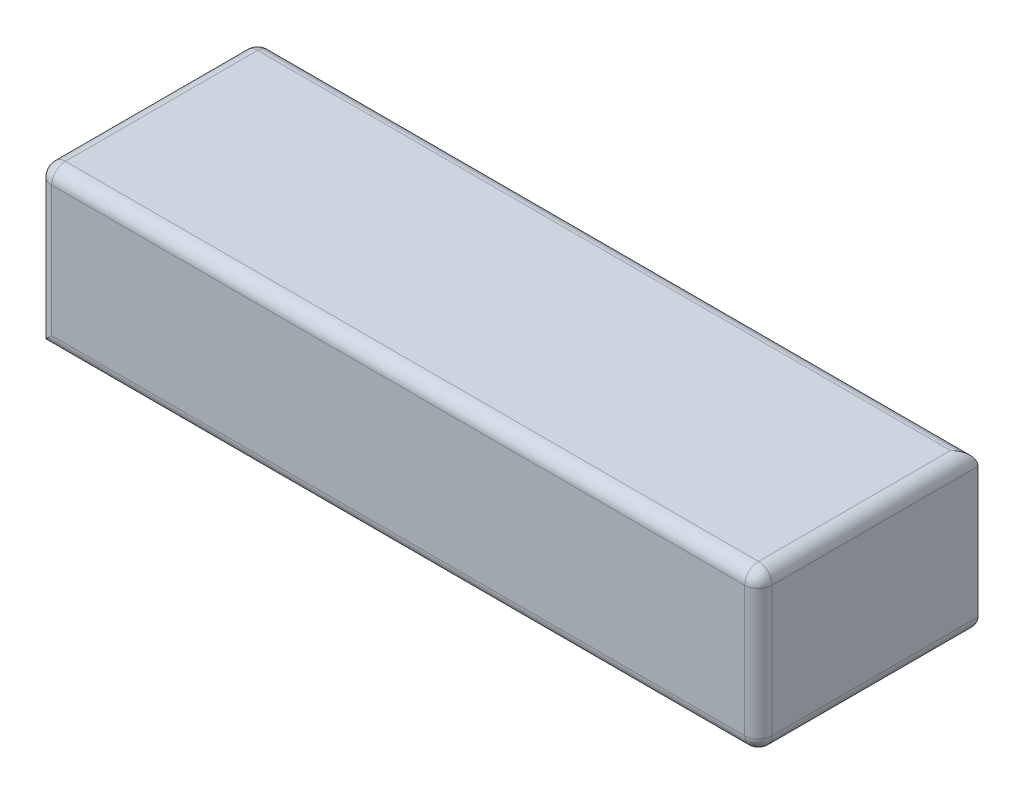
ISO-10303-21;
HEADER;
FILE_DESCRIPTION(('STEP AP214'),'2;1');
FILE_NAME('part.step','',(''),(''),'','','');
FILE_SCHEMA(('AUTOMOTIVE_DESIGN { 1 0 10303 214 1 1 1 1 }'));
ENDSEC;
DATA;
#1=APPLICATION_CONTEXT('core data for automotive mechanical design processes');
#2=APPLICATION_PROTOCOL_DEFINITION('international standard','automotive_design',2000,#1);
#3=PRODUCT_CONTEXT('',#1,'mechanical');
#4=PRODUCT('Part','Part','',(#3));
#5=PRODUCT_RELATED_PRODUCT_CATEGORY('part','',(#4));
#6=PRODUCT_DEFINITION_FORMATION('','',#4);
#7=PRODUCT_DEFINITION_CONTEXT('part definition',#1,'design');
#8=PRODUCT_DEFINITION('design','',#6,#7);
#9=PRODUCT_DEFINITION_SHAPE('','',#8);
#10=(LENGTH_UNIT() NAMED_UNIT(*) SI_UNIT(.MILLI.,.METRE.));
#11=(NAMED_UNIT(*) PLANE_ANGLE_UNIT() SI_UNIT($,.RADIAN.));
#12=(NAMED_UNIT(*) SI_UNIT($,.STERADIAN.) SOLID_ANGLE_UNIT());
#13=UNCERTAINTY_MEASURE_WITH_UNIT(LENGTH_MEASURE(1.E-05),#10,'distance_accuracy_value','');
#14=(GEOMETRIC_REPRESENTATION_CONTEXT(3) GLOBAL_UNCERTAINTY_ASSIGNED_CONTEXT((#13)) GLOBAL_UNIT_ASSIGNED_CONTEXT((#10,
#11,#12)) REPRESENTATION_CONTEXT('',''));
#15=CARTESIAN_POINT('',(0.,0.,0.));
#16=DIRECTION('',(0.,0.,1.));
#17=DIRECTION('',(1.,0.,0.));
#18=AXIS2_PLACEMENT_3D('',#15,#16,#17);
#19=CARTESIAN_POINT('',(52.5,23.,16.));
#20=DIRECTION('',(-1.,0.,0.));
#21=DIRECTION('',(0.,0.,1.));
#22=AXIS2_PLACEMENT_3D('',#19,#20,#21);
#23=PLANE('',#22);
#24=DIRECTION('',(0.,-1.,0.));
#25=VECTOR('',#24,1.);
#26=CARTESIAN_POINT('',(52.5,23.,-16.));
#27=LINE('',#26,#25);
#28=CARTESIAN_POINT('',(52.5,21.,-16.));
#29=VERTEX_POINT('',#28);
#30=CARTESIAN_POINT('',(52.5,2.,-16.));
#31=VERTEX_POINT('',#30);
#32=EDGE_CURVE('E138',#29,#31,#27,.T.);
#33=ORIENTED_EDGE('',*,*,#32,.F.);
#34=DIRECTION('',(0.,0.,-1.));
#35=VECTOR('',#34,1.);
#36=CARTESIAN_POINT('',(52.5,21.,16.));
#37=LINE('',#36,#35);
#38=CARTESIAN_POINT('',(52.5,21.,14.));
#39=VERTEX_POINT('',#38);
#40=EDGE_CURVE('E173',#29,#39,#37,.F.);
#41=ORIENTED_EDGE('',*,*,#40,.T.);
#42=DIRECTION('',(0.,-1.,0.));
#43=VECTOR('',#42,1.);
#44=CARTESIAN_POINT('',(52.5,23.,14.));
#45=LINE('',#44,#43);
#46=CARTESIAN_POINT('',(52.5,2.,14.));
#47=VERTEX_POINT('',#46);
#48=EDGE_CURVE('E171',#39,#47,#45,.T.);
#49=ORIENTED_EDGE('',*,*,#48,.T.);
#50=DIRECTION('',(0.,0.,-1.));
#51=VECTOR('',#50,1.);
#52=CARTESIAN_POINT('',(52.5,2.,-16.));
#53=LINE('',#52,#51);
#54=EDGE_CURVE('E169',#47,#31,#53,.T.);
#55=ORIENTED_EDGE('',*,*,#54,.T.);
#56=EDGE_LOOP('',(#33,#41,#49,#55));
#57=FACE_BOUND('',#56,.T.);
#58=ADVANCED_FACE('F32',(#57),#23,.F.);
#59=CARTESIAN_POINT('',(-52.5,23.,-16.));
#60=DIRECTION('',(0.,0.,1.));
#61=DIRECTION('',(1.,0.,0.));
#62=AXIS2_PLACEMENT_3D('',#59,#60,#61);
#63=PLANE('',#62);
#64=DIRECTION('',(0.,-1.,0.));
#65=VECTOR('',#64,1.);
#66=CARTESIAN_POINT('',(-50.5,23.,-16.));
#67=LINE('',#66,#65);
#68=CARTESIAN_POINT('',(-50.5,2.,-16.));
#69=VERTEX_POINT('',#68);
#70=CARTESIAN_POINT('',(-50.5,21.,-16.));
#71=VERTEX_POINT('',#70);
#72=EDGE_CURVE('E164',#69,#71,#67,.F.);
#73=ORIENTED_EDGE('',*,*,#72,.T.);
#74=DIRECTION('',(-1.,0.,0.));
#75=VECTOR('',#74,1.);
#76=CARTESIAN_POINT('',(-52.5,21.,-16.));
#77=LINE('',#76,#75);
#78=EDGE_CURVE('E166',#71,#29,#77,.F.);
#79=ORIENTED_EDGE('',*,*,#78,.T.);
#80=ORIENTED_EDGE('',*,*,#32,.T.);
#81=DIRECTION('',(-1.,0.,0.));
#82=VECTOR('',#81,1.);
#83=CARTESIAN_POINT('',(-52.5,2.,-16.));
#84=LINE('',#83,#82);
#85=EDGE_CURVE('E162',#31,#69,#84,.T.);
#86=ORIENTED_EDGE('',*,*,#85,.T.);
#87=EDGE_LOOP('',(#73,#79,#80,#86));
#88=FACE_BOUND('',#87,.T.);
#89=ADVANCED_FACE('F260',(#88),#63,.F.);
#90=CARTESIAN_POINT('',(-52.5,23.,16.));
#91=DIRECTION('',(1.,0.,0.));
#92=DIRECTION('',(0.,0.,-1.));
#93=AXIS2_PLACEMENT_3D('',#90,#91,#92);
#94=PLANE('',#93);
#95=DIRECTION('',(0.,0.,1.));
#96=VECTOR('',#95,1.);
#97=CARTESIAN_POINT('',(-52.5,21.,16.));
#98=LINE('',#97,#96);
#99=CARTESIAN_POINT('',(-52.5,21.,14.));
#100=VERTEX_POINT('',#99);
#101=CARTESIAN_POINT('',(-52.5,21.,-14.));
#102=VERTEX_POINT('',#101);
#103=EDGE_CURVE('E157',#100,#102,#98,.F.);
#104=ORIENTED_EDGE('',*,*,#103,.T.);
#105=DIRECTION('',(0.,-1.,0.));
#106=VECTOR('',#105,1.);
#107=CARTESIAN_POINT('',(-52.5,23.,-14.));
#108=LINE('',#107,#106);
#109=CARTESIAN_POINT('',(-52.5,0.,-14.));
#110=VERTEX_POINT('',#109);
#111=EDGE_CURVE('E160',#102,#110,#108,.T.);
#112=ORIENTED_EDGE('',*,*,#111,.T.);
#113=DIRECTION('',(0.,0.,1.));
#114=VECTOR('',#113,1.);
#115=CARTESIAN_POINT('',(-52.5,0.,16.));
#116=LINE('',#115,#114);
#117=CARTESIAN_POINT('',(-52.5,0.,14.));
#118=VERTEX_POINT('',#117);
#119=EDGE_CURVE('E209',#110,#118,#116,.T.);
#120=ORIENTED_EDGE('',*,*,#119,.T.);
#121=DIRECTION('',(0.,-1.,0.));
#122=VECTOR('',#121,1.);
#123=CARTESIAN_POINT('',(-52.5,23.,14.));
#124=LINE('',#123,#122);
#125=EDGE_CURVE('E155',#118,#100,#124,.F.);
#126=ORIENTED_EDGE('',*,*,#125,.T.);
#127=EDGE_LOOP('',(#104,#112,#120,#126));
#128=FACE_BOUND('',#127,.T.);
#129=ADVANCED_FACE('F262',(#128),#94,.F.);
#130=CARTESIAN_POINT('',(-52.5,23.,16.));
#131=DIRECTION('',(0.,0.,-1.));
#132=DIRECTION('',(-1.,0.,0.));
#133=AXIS2_PLACEMENT_3D('',#130,#131,#132);
#134=PLANE('',#133);
#135=DIRECTION('',(0.,-1.,0.));
#136=VECTOR('',#135,1.);
#137=CARTESIAN_POINT('',(50.5,23.,16.));
#138=LINE('',#137,#136);
#139=CARTESIAN_POINT('',(50.5,2.,16.));
#140=VERTEX_POINT('',#139);
#141=CARTESIAN_POINT('',(50.5,21.,16.));
#142=VERTEX_POINT('',#141);
#143=EDGE_CURVE('E144',#140,#142,#138,.F.);
#144=ORIENTED_EDGE('',*,*,#143,.T.);
#145=DIRECTION('',(1.,0.,0.));
#146=VECTOR('',#145,1.);
#147=CARTESIAN_POINT('',(-52.5,21.,16.));
#148=LINE('',#147,#146);
#149=CARTESIAN_POINT('',(-50.5,21.,16.));
#150=VERTEX_POINT('',#149);
#151=EDGE_CURVE('E116',#142,#150,#148,.F.);
#152=ORIENTED_EDGE('',*,*,#151,.T.);
#153=DIRECTION('',(0.,-1.,0.));
#154=VECTOR('',#153,1.);
#155=CARTESIAN_POINT('',(-50.5,23.,16.));
#156=LINE('',#155,#154);
#157=CARTESIAN_POINT('',(-50.5,2.,16.));
#158=VERTEX_POINT('',#157);
#159=EDGE_CURVE('E152',#150,#158,#156,.T.);
#160=ORIENTED_EDGE('',*,*,#159,.T.);
#161=DIRECTION('',(1.,0.,0.));
#162=VECTOR('',#161,1.);
#163=CARTESIAN_POINT('',(52.5,2.,16.));
#164=LINE('',#163,#162);
#165=EDGE_CURVE('E146',#158,#140,#164,.T.);
#166=ORIENTED_EDGE('',*,*,#165,.T.);
#167=EDGE_LOOP('',(#144,#152,#160,#166));
#168=FACE_BOUND('',#167,.T.);
#169=ADVANCED_FACE('F241',(#168),#134,.F.);
#170=CARTESIAN_POINT('',(0.,23.,0.));
#171=DIRECTION('',(0.,-1.,0.));
#172=DIRECTION('',(0.,0.,-1.));
#173=AXIS2_PLACEMENT_3D('',#170,#171,#172);
#174=PLANE('',#173);
#175=DIRECTION('',(0.,0.,1.));
#176=VECTOR('',#175,1.);
#177=CARTESIAN_POINT('',(-50.5,23.,0.));
#178=LINE('',#177,#176);
#179=CARTESIAN_POINT('',(-50.5,23.,-14.));
#180=VERTEX_POINT('',#179);
#181=CARTESIAN_POINT('',(-50.5,23.,14.));
#182=VERTEX_POINT('',#181);
#183=EDGE_CURVE('E142',#180,#182,#178,.T.);
#184=ORIENTED_EDGE('',*,*,#183,.T.);
#185=DIRECTION('',(1.,0.,0.));
#186=VECTOR('',#185,1.);
#187=CARTESIAN_POINT('',(0.,23.,14.));
#188=LINE('',#187,#186);
#189=CARTESIAN_POINT('',(50.5,23.,14.));
#190=VERTEX_POINT('',#189);
#191=EDGE_CURVE('E114',#182,#190,#188,.T.);
#192=ORIENTED_EDGE('',*,*,#191,.T.);
#193=DIRECTION('',(0.,0.,-1.));
#194=VECTOR('',#193,1.);
#195=CARTESIAN_POINT('',(50.5,23.,0.));
#196=LINE('',#195,#194);
#197=CARTESIAN_POINT('',(50.5,23.,-14.));
#198=VERTEX_POINT('',#197);
#199=EDGE_CURVE('E131',#190,#198,#196,.T.);
#200=ORIENTED_EDGE('',*,*,#199,.T.);
#201=DIRECTION('',(-1.,0.,0.));
#202=VECTOR('',#201,1.);
#203=CARTESIAN_POINT('',(0.,23.,-14.));
#204=LINE('',#203,#202);
#205=EDGE_CURVE('E137',#198,#180,#204,.T.);
#206=ORIENTED_EDGE('',*,*,#205,.T.);
#207=EDGE_LOOP('',(#184,#192,#200,#206));
#208=FACE_BOUND('',#207,.T.);
#209=ADVANCED_FACE('F140',(#208),#174,.F.);
#210=CARTESIAN_POINT('',(0.,0.,0.));
#211=DIRECTION('',(0.,-1.,0.));
#212=DIRECTION('',(0.,0.,-1.));
#213=AXIS2_PLACEMENT_3D('',#210,#211,#212);
#214=PLANE('',#213);
#215=DIRECTION('',(0.,0.,-1.));
#216=VECTOR('',#215,1.);
#217=CARTESIAN_POINT('',(50.5,0.,16.));
#218=LINE('',#217,#216);
#219=CARTESIAN_POINT('',(50.5,0.,-14.));
#220=VERTEX_POINT('',#219);
#221=CARTESIAN_POINT('',(50.5,0.,14.));
#222=VERTEX_POINT('',#221);
#223=EDGE_CURVE('E48',#220,#222,#218,.F.);
#224=ORIENTED_EDGE('',*,*,#223,.T.);
#225=DIRECTION('',(1.,0.,0.));
#226=VECTOR('',#225,1.);
#227=CARTESIAN_POINT('',(-52.5,0.,14.));
#228=LINE('',#227,#226);
#229=EDGE_CURVE('E11',#222,#118,#228,.F.);
#230=ORIENTED_EDGE('',*,*,#229,.T.);
#231=ORIENTED_EDGE('',*,*,#119,.F.);
#232=DIRECTION('',(-1.,0.,0.));
#233=VECTOR('',#232,1.);
#234=CARTESIAN_POINT('',(52.5,0.,-14.));
#235=LINE('',#234,#233);
#236=EDGE_CURVE('E41',#110,#220,#235,.F.);
#237=ORIENTED_EDGE('',*,*,#236,.T.);
#238=EDGE_LOOP('',(#224,#230,#231,#237));
#239=FACE_BOUND('',#238,.T.);
#240=ADVANCED_FACE('F256',(#239),#214,.T.);
#241=CARTESIAN_POINT('',(-52.5,2.,-14.));
#242=DIRECTION('',(1.,0.,0.));
#243=DIRECTION('',(0.,0.,-1.));
#244=AXIS2_PLACEMENT_3D('',#241,#242,#243);
#245=CYLINDRICAL_SURFACE('',#244,2.);
#246=CARTESIAN_POINT('',(50.5,2.,-14.));
#247=DIRECTION('',(0.707106781186547,0.,0.707106781186547));
#248=DIRECTION('',(-0.707106781186547,0.,0.707106781186547));
#249=AXIS2_PLACEMENT_3D('',#246,#247,#248);
#250=ELLIPSE('',#249,2.82842712474619,2.);
#251=EDGE_CURVE('E204',#220,#31,#250,.T.);
#252=ORIENTED_EDGE('',*,*,#251,.F.);
#253=ORIENTED_EDGE('',*,*,#236,.F.);
#254=CARTESIAN_POINT('',(-50.5,2.,-14.));
#255=DIRECTION('',(0.707106781186547,-0.707106781186547,0.));
#256=DIRECTION('',(0.707106781186547,0.707106781186547,0.));
#257=AXIS2_PLACEMENT_3D('',#254,#255,#256);
#258=ELLIPSE('',#257,2.82842712474619,2.);
#259=EDGE_CURVE('E36',#69,#110,#258,.F.);
#260=ORIENTED_EDGE('',*,*,#259,.F.);
#261=ORIENTED_EDGE('',*,*,#85,.F.);
#262=EDGE_LOOP('',(#252,#253,#260,#261));
#263=FACE_BOUND('',#262,.T.);
#264=ADVANCED_FACE('F34',(#263),#245,.T.);
#265=CARTESIAN_POINT('',(-50.5,23.,-14.));
#266=DIRECTION('',(0.,-1.,0.));
#267=DIRECTION('',(0.,0.,-1.));
#268=AXIS2_PLACEMENT_3D('',#265,#266,#267);
#269=CYLINDRICAL_SURFACE('',#268,2.);
#270=ORIENTED_EDGE('',*,*,#259,.T.);
#271=ORIENTED_EDGE('',*,*,#111,.F.);
#272=CARTESIAN_POINT('',(-50.5,21.,-14.));
#273=DIRECTION('',(0.,1.,0.));
#274=DIRECTION('',(0.,0.,1.));
#275=AXIS2_PLACEMENT_3D('',#272,#273,#274);
#276=CIRCLE('',#275,2.);
#277=EDGE_CURVE('E202',#71,#102,#276,.T.);
#278=ORIENTED_EDGE('',*,*,#277,.F.);
#279=ORIENTED_EDGE('',*,*,#72,.F.);
#280=EDGE_LOOP('',(#270,#271,#278,#279));
#281=FACE_BOUND('',#280,.T.);
#282=ADVANCED_FACE('F261',(#281),#269,.T.);
#283=CARTESIAN_POINT('',(50.5,2.,16.));
#284=DIRECTION('',(0.,0.,1.));
#285=DIRECTION('',(1.,0.,0.));
#286=AXIS2_PLACEMENT_3D('',#283,#284,#285);
#287=CYLINDRICAL_SURFACE('',#286,2.);
#288=ORIENTED_EDGE('',*,*,#251,.T.);
#289=ORIENTED_EDGE('',*,*,#54,.F.);
#290=CARTESIAN_POINT('',(50.5,2.,14.));
#291=DIRECTION('',(0.,0.,1.));
#292=DIRECTION('',(1.,0.,0.));
#293=AXIS2_PLACEMENT_3D('',#290,#291,#292);
#294=CIRCLE('',#293,2.);
#295=EDGE_CURVE('E196',#222,#47,#294,.T.);
#296=ORIENTED_EDGE('',*,*,#295,.F.);
#297=ORIENTED_EDGE('',*,*,#223,.F.);
#298=EDGE_LOOP('',(#288,#289,#296,#297));
#299=FACE_BOUND('',#298,.T.);
#300=ADVANCED_FACE('F251',(#299),#287,.T.);
#301=CARTESIAN_POINT('',(-52.5,2.,14.));
#302=DIRECTION('',(-1.,0.,0.));
#303=DIRECTION('',(0.,0.,1.));
#304=AXIS2_PLACEMENT_3D('',#301,#302,#303);
#305=CYLINDRICAL_SURFACE('',#304,2.);
#306=CARTESIAN_POINT('',(-50.5,2.,14.));
#307=DIRECTION('',(-0.707106781186547,0.707106781186547,0.));
#308=DIRECTION('',(-0.707106781186547,-0.707106781186547,0.));
#309=AXIS2_PLACEMENT_3D('',#306,#307,#308);
#310=ELLIPSE('',#309,2.82842712474619,2.);
#311=EDGE_CURVE('E190',#118,#158,#310,.T.);
#312=ORIENTED_EDGE('',*,*,#311,.F.);
#313=ORIENTED_EDGE('',*,*,#229,.F.);
#314=CARTESIAN_POINT('',(50.5,2.,14.));
#315=DIRECTION('',(1.,0.,0.));
#316=DIRECTION('',(0.,0.,-1.));
#317=AXIS2_PLACEMENT_3D('',#314,#315,#316);
#318=CIRCLE('',#317,2.);
#319=EDGE_CURVE('E193',#140,#222,#318,.T.);
#320=ORIENTED_EDGE('',*,*,#319,.F.);
#321=ORIENTED_EDGE('',*,*,#165,.F.);
#322=EDGE_LOOP('',(#312,#313,#320,#321));
#323=FACE_BOUND('',#322,.T.);
#324=ADVANCED_FACE('F255',(#323),#305,.T.);
#325=CARTESIAN_POINT('',(-50.5,21.,-14.));
#326=DIRECTION('',(0.,0.,1.));
#327=DIRECTION('',(1.,0.,0.));
#328=AXIS2_PLACEMENT_3D('',#325,#326,#327);
#329=SPHERICAL_SURFACE('',#328,2.);
#330=CARTESIAN_POINT('',(-50.5,21.,-14.));
#331=DIRECTION('',(0.,0.,-1.));
#332=DIRECTION('',(0.,1.,0.));
#333=AXIS2_PLACEMENT_3D('',#330,#331,#332);
#334=CIRCLE('',#333,2.);
#335=EDGE_CURVE('E188',#180,#102,#334,.F.);
#336=ORIENTED_EDGE('',*,*,#335,.F.);
#337=CARTESIAN_POINT('',(-50.5,21.,-14.));
#338=DIRECTION('',(-1.,0.,0.));
#339=DIRECTION('',(0.,0.,1.));
#340=AXIS2_PLACEMENT_3D('',#337,#338,#339);
#341=CIRCLE('',#340,2.);
#342=EDGE_CURVE('E199',#71,#180,#341,.F.);
#343=ORIENTED_EDGE('',*,*,#342,.F.);
#344=ORIENTED_EDGE('',*,*,#277,.T.);
#345=EDGE_LOOP('',(#336,#343,#344));
#346=FACE_BOUND('',#345,.T.);
#347=ADVANCED_FACE('F226',(#346),#329,.T.);
#348=CARTESIAN_POINT('',(0.,21.,-14.));
#349=DIRECTION('',(-1.,0.,0.));
#350=DIRECTION('',(0.,0.,1.));
#351=AXIS2_PLACEMENT_3D('',#348,#349,#350);
#352=CYLINDRICAL_SURFACE('',#351,2.);
#353=ORIENTED_EDGE('',*,*,#342,.T.);
#354=ORIENTED_EDGE('',*,*,#205,.F.);
#355=CARTESIAN_POINT('',(50.5,21.,-14.));
#356=DIRECTION('',(-0.707106781186547,0.,-0.707106781186547));
#357=DIRECTION('',(0.707106781186547,0.,-0.707106781186547));
#358=AXIS2_PLACEMENT_3D('',#355,#356,#357);
#359=ELLIPSE('',#358,2.82842712474619,2.);
#360=EDGE_CURVE('E134',#29,#198,#359,.F.);
#361=ORIENTED_EDGE('',*,*,#360,.F.);
#362=ORIENTED_EDGE('',*,*,#78,.F.);
#363=EDGE_LOOP('',(#353,#354,#361,#362));
#364=FACE_BOUND('',#363,.T.);
#365=ADVANCED_FACE('F224',(#364),#352,.T.);
#366=CARTESIAN_POINT('',(50.5,2.,14.));
#367=DIRECTION('',(0.,0.,1.));
#368=DIRECTION('',(1.,0.,0.));
#369=AXIS2_PLACEMENT_3D('',#366,#367,#368);
#370=SPHERICAL_SURFACE('',#369,2.);
#371=ORIENTED_EDGE('',*,*,#319,.T.);
#372=ORIENTED_EDGE('',*,*,#295,.T.);
#373=CARTESIAN_POINT('',(50.5,2.,14.));
#374=DIRECTION('',(0.,-1.,0.));
#375=DIRECTION('',(0.,0.,-1.));
#376=AXIS2_PLACEMENT_3D('',#373,#374,#375);
#377=CIRCLE('',#376,2.);
#378=EDGE_CURVE('E184',#140,#47,#377,.F.);
#379=ORIENTED_EDGE('',*,*,#378,.F.);
#380=EDGE_LOOP('',(#371,#372,#379));
#381=FACE_BOUND('',#380,.T.);
#382=ADVANCED_FACE('F253',(#381),#370,.T.);
#383=CARTESIAN_POINT('',(-50.5,23.,14.));
#384=DIRECTION('',(0.,-1.,0.));
#385=DIRECTION('',(0.,0.,-1.));
#386=AXIS2_PLACEMENT_3D('',#383,#384,#385);
#387=CYLINDRICAL_SURFACE('',#386,2.);
#388=ORIENTED_EDGE('',*,*,#311,.T.);
#389=ORIENTED_EDGE('',*,*,#159,.F.);
#390=CARTESIAN_POINT('',(-50.5,21.,14.));
#391=DIRECTION('',(0.,1.,0.));
#392=DIRECTION('',(0.,0.,1.));
#393=AXIS2_PLACEMENT_3D('',#390,#391,#392);
#394=CIRCLE('',#393,2.);
#395=EDGE_CURVE('E181',#100,#150,#394,.T.);
#396=ORIENTED_EDGE('',*,*,#395,.F.);
#397=ORIENTED_EDGE('',*,*,#125,.F.);
#398=EDGE_LOOP('',(#388,#389,#396,#397));
#399=FACE_BOUND('',#398,.T.);
#400=ADVANCED_FACE('F238',(#399),#387,.T.);
#401=CARTESIAN_POINT('',(-50.5,21.,0.));
#402=DIRECTION('',(0.,0.,1.));
#403=DIRECTION('',(1.,0.,0.));
#404=AXIS2_PLACEMENT_3D('',#401,#402,#403);
#405=CYLINDRICAL_SURFACE('',#404,2.);
#406=ORIENTED_EDGE('',*,*,#335,.T.);
#407=ORIENTED_EDGE('',*,*,#103,.F.);
#408=CARTESIAN_POINT('',(-50.5,21.,14.));
#409=DIRECTION('',(0.,0.,1.));
#410=DIRECTION('',(1.,0.,0.));
#411=AXIS2_PLACEMENT_3D('',#408,#409,#410);
#412=CIRCLE('',#411,2.);
#413=EDGE_CURVE('E128',#182,#100,#412,.T.);
#414=ORIENTED_EDGE('',*,*,#413,.F.);
#415=ORIENTED_EDGE('',*,*,#183,.F.);
#416=EDGE_LOOP('',(#406,#407,#414,#415));
#417=FACE_BOUND('',#416,.T.);
#418=ADVANCED_FACE('F230',(#417),#405,.T.);
#419=CARTESIAN_POINT('',(50.5,21.,0.));
#420=DIRECTION('',(0.,0.,-1.));
#421=DIRECTION('',(-1.,0.,0.));
#422=AXIS2_PLACEMENT_3D('',#419,#420,#421);
#423=CYLINDRICAL_SURFACE('',#422,2.);
#424=ORIENTED_EDGE('',*,*,#360,.T.);
#425=ORIENTED_EDGE('',*,*,#199,.F.);
#426=CARTESIAN_POINT('',(50.5,21.,14.));
#427=DIRECTION('',(0.,0.,1.));
#428=DIRECTION('',(1.,0.,0.));
#429=AXIS2_PLACEMENT_3D('',#426,#427,#428);
#430=CIRCLE('',#429,2.);
#431=EDGE_CURVE('E122',#39,#190,#430,.T.);
#432=ORIENTED_EDGE('',*,*,#431,.F.);
#433=ORIENTED_EDGE('',*,*,#40,.F.);
#434=EDGE_LOOP('',(#424,#425,#432,#433));
#435=FACE_BOUND('',#434,.T.);
#436=ADVANCED_FACE('F132',(#435),#423,.T.);
#437=CARTESIAN_POINT('',(50.5,23.,14.));
#438=DIRECTION('',(0.,-1.,0.));
#439=DIRECTION('',(0.,0.,-1.));
#440=AXIS2_PLACEMENT_3D('',#437,#438,#439);
#441=CYLINDRICAL_SURFACE('',#440,2.);
#442=ORIENTED_EDGE('',*,*,#378,.T.);
#443=ORIENTED_EDGE('',*,*,#48,.F.);
#444=CARTESIAN_POINT('',(50.5,21.,14.));
#445=DIRECTION('',(0.,1.,0.));
#446=DIRECTION('',(0.,0.,1.));
#447=AXIS2_PLACEMENT_3D('',#444,#445,#446);
#448=CIRCLE('',#447,2.);
#449=EDGE_CURVE('E126',#142,#39,#448,.T.);
#450=ORIENTED_EDGE('',*,*,#449,.F.);
#451=ORIENTED_EDGE('',*,*,#143,.F.);
#452=EDGE_LOOP('',(#442,#443,#450,#451));
#453=FACE_BOUND('',#452,.T.);
#454=ADVANCED_FACE('F246',(#453),#441,.T.);
#455=CARTESIAN_POINT('',(-50.5,21.,14.));
#456=DIRECTION('',(0.,0.,1.));
#457=DIRECTION('',(1.,0.,0.));
#458=AXIS2_PLACEMENT_3D('',#455,#456,#457);
#459=SPHERICAL_SURFACE('',#458,2.);
#460=ORIENTED_EDGE('',*,*,#413,.T.);
#461=ORIENTED_EDGE('',*,*,#395,.T.);
#462=CARTESIAN_POINT('',(-50.5,21.,14.));
#463=DIRECTION('',(-1.,0.,0.));
#464=DIRECTION('',(0.,0.,1.));
#465=AXIS2_PLACEMENT_3D('',#462,#463,#464);
#466=CIRCLE('',#465,2.);
#467=EDGE_CURVE('E119',#182,#150,#466,.F.);
#468=ORIENTED_EDGE('',*,*,#467,.F.);
#469=EDGE_LOOP('',(#460,#461,#468));
#470=FACE_BOUND('',#469,.T.);
#471=ADVANCED_FACE('F234',(#470),#459,.T.);
#472=CARTESIAN_POINT('',(50.5,21.,14.));
#473=DIRECTION('',(0.,0.,1.));
#474=DIRECTION('',(1.,0.,0.));
#475=AXIS2_PLACEMENT_3D('',#472,#473,#474);
#476=SPHERICAL_SURFACE('',#475,2.);
#477=ORIENTED_EDGE('',*,*,#449,.T.);
#478=ORIENTED_EDGE('',*,*,#431,.T.);
#479=CARTESIAN_POINT('',(50.5,21.,14.));
#480=DIRECTION('',(1.,0.,0.));
#481=DIRECTION('',(0.,0.,-1.));
#482=AXIS2_PLACEMENT_3D('',#479,#480,#481);
#483=CIRCLE('',#482,2.);
#484=EDGE_CURVE('E110',#142,#190,#483,.F.);
#485=ORIENTED_EDGE('',*,*,#484,.F.);
#486=EDGE_LOOP('',(#477,#478,#485));
#487=FACE_BOUND('',#486,.T.);
#488=ADVANCED_FACE('F124',(#487),#476,.T.);
#489=CARTESIAN_POINT('',(0.,21.,14.));
#490=DIRECTION('',(1.,0.,0.));
#491=DIRECTION('',(0.,0.,-1.));
#492=AXIS2_PLACEMENT_3D('',#489,#490,#491);
#493=CYLINDRICAL_SURFACE('',#492,2.);
#494=ORIENTED_EDGE('',*,*,#467,.T.);
#495=ORIENTED_EDGE('',*,*,#151,.F.);
#496=ORIENTED_EDGE('',*,*,#484,.T.);
#497=ORIENTED_EDGE('',*,*,#191,.F.);
#498=EDGE_LOOP('',(#494,#495,#496,#497));
#499=FACE_BOUND('',#498,.T.);
#500=ADVANCED_FACE('F112',(#499),#493,.T.);
#501=CLOSED_SHELL('',(#58,#89,#129,#169,#209,#240,#264,#282,#300,#324,#347,#365,#382,#400,#418,
#436,#454,#471,#488,#500));
#502=MANIFOLD_SOLID_BREP('B2',#501);
#503=ADVANCED_BREP_SHAPE_REPRESENTATION('',(#18,#502),#14);
#504=SHAPE_DEFINITION_REPRESENTATION(#9,#503);
ENDSEC;
END-ISO-10303-21;
